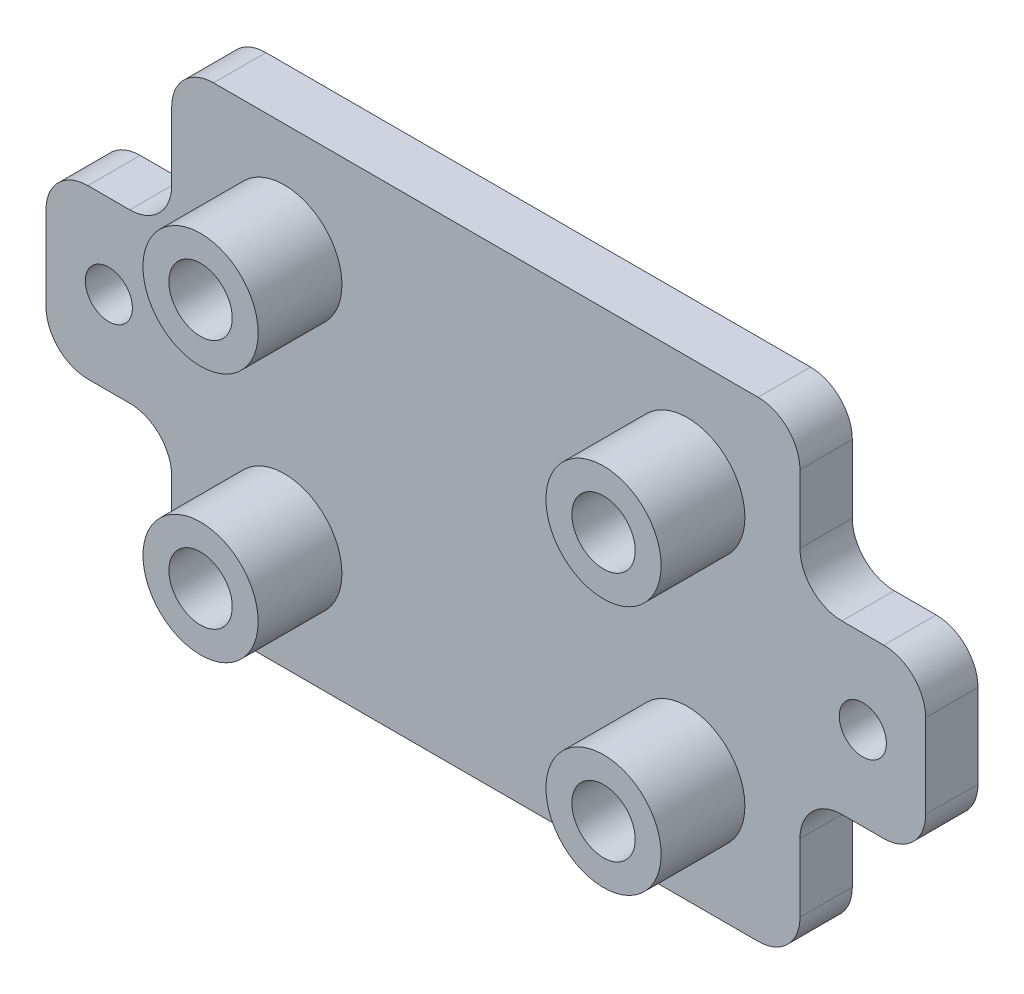
ISO-10303-21;
HEADER;
FILE_DESCRIPTION(('STEP AP214'),'2;1');
FILE_NAME('part.step','',(''),(''),'','','');
FILE_SCHEMA(('AUTOMOTIVE_DESIGN { 1 0 10303 214 1 1 1 1 }'));
ENDSEC;
DATA;
#1=APPLICATION_CONTEXT('core data for automotive mechanical design processes');
#2=APPLICATION_PROTOCOL_DEFINITION('international standard','automotive_design',2000,#1);
#3=PRODUCT_CONTEXT('',#1,'mechanical');
#4=PRODUCT('Part','Part','',(#3));
#5=PRODUCT_RELATED_PRODUCT_CATEGORY('part','',(#4));
#6=PRODUCT_DEFINITION_FORMATION('','',#4);
#7=PRODUCT_DEFINITION_CONTEXT('part definition',#1,'design');
#8=PRODUCT_DEFINITION('design','',#6,#7);
#9=PRODUCT_DEFINITION_SHAPE('','',#8);
#10=(LENGTH_UNIT() NAMED_UNIT(*) SI_UNIT(.MILLI.,.METRE.));
#11=(NAMED_UNIT(*) PLANE_ANGLE_UNIT() SI_UNIT($,.RADIAN.));
#12=(NAMED_UNIT(*) SI_UNIT($,.STERADIAN.) SOLID_ANGLE_UNIT());
#13=UNCERTAINTY_MEASURE_WITH_UNIT(LENGTH_MEASURE(1.E-05),#10,'distance_accuracy_value','');
#14=(GEOMETRIC_REPRESENTATION_CONTEXT(3) GLOBAL_UNCERTAINTY_ASSIGNED_CONTEXT((#13)) GLOBAL_UNIT_ASSIGNED_CONTEXT((#10,
#11,#12)) REPRESENTATION_CONTEXT('',''));
#15=CARTESIAN_POINT('',(0.,0.,0.));
#16=DIRECTION('',(0.,0.,1.));
#17=DIRECTION('',(1.,0.,0.));
#18=AXIS2_PLACEMENT_3D('',#15,#16,#17);
#19=CARTESIAN_POINT('',(30.,-22.5,5.));
#20=DIRECTION('',(-1.,0.,0.));
#21=DIRECTION('',(0.,0.,1.));
#22=AXIS2_PLACEMENT_3D('',#19,#20,#21);
#23=PLANE('',#22);
#24=DIRECTION('',(0.,1.,0.));
#25=VECTOR('',#24,1.);
#26=CARTESIAN_POINT('',(30.,-22.5,0.));
#27=LINE('',#26,#25);
#28=CARTESIAN_POINT('',(30.,12.,0.));
#29=VERTEX_POINT('',#28);
#30=CARTESIAN_POINT('',(30.,18.5,0.));
#31=VERTEX_POINT('',#30);
#32=EDGE_CURVE('E225',#29,#31,#27,.T.);
#33=ORIENTED_EDGE('',*,*,#32,.T.);
#34=DIRECTION('',(0.,0.,-1.));
#35=VECTOR('',#34,1.);
#36=CARTESIAN_POINT('',(30.,18.5,5.));
#37=LINE('',#36,#35);
#38=CARTESIAN_POINT('',(30.,18.5,5.));
#39=VERTEX_POINT('',#38);
#40=EDGE_CURVE('E324',#31,#39,#37,.F.);
#41=ORIENTED_EDGE('',*,*,#40,.T.);
#42=DIRECTION('',(0.,1.,0.));
#43=VECTOR('',#42,1.);
#44=CARTESIAN_POINT('',(30.,-22.5,5.));
#45=LINE('',#44,#43);
#46=CARTESIAN_POINT('',(30.,12.,5.));
#47=VERTEX_POINT('',#46);
#48=EDGE_CURVE('E366',#47,#39,#45,.T.);
#49=ORIENTED_EDGE('',*,*,#48,.F.);
#50=DIRECTION('',(0.,0.,1.));
#51=VECTOR('',#50,1.);
#52=CARTESIAN_POINT('',(30.,12.,5.));
#53=LINE('',#52,#51);
#54=EDGE_CURVE('E322',#47,#29,#53,.F.);
#55=ORIENTED_EDGE('',*,*,#54,.T.);
#56=EDGE_LOOP('',(#33,#41,#49,#55));
#57=FACE_BOUND('',#56,.T.);
#58=ADVANCED_FACE('F37',(#57),#23,.F.);
#59=CARTESIAN_POINT('',(-30.,-22.5,5.));
#60=DIRECTION('',(1.,0.,0.));
#61=DIRECTION('',(0.,0.,-1.));
#62=AXIS2_PLACEMENT_3D('',#59,#60,#61);
#63=PLANE('',#62);
#64=DIRECTION('',(0.,-1.,0.));
#65=VECTOR('',#64,1.);
#66=CARTESIAN_POINT('',(-30.,-22.5,0.));
#67=LINE('',#66,#65);
#68=CARTESIAN_POINT('',(-30.,-11.9999999999997,0.));
#69=VERTEX_POINT('',#68);
#70=CARTESIAN_POINT('',(-30.,-18.5,0.));
#71=VERTEX_POINT('',#70);
#72=EDGE_CURVE('E232',#69,#71,#67,.T.);
#73=ORIENTED_EDGE('',*,*,#72,.T.);
#74=DIRECTION('',(0.,0.,-1.));
#75=VECTOR('',#74,1.);
#76=CARTESIAN_POINT('',(-30.,-18.5,5.));
#77=LINE('',#76,#75);
#78=CARTESIAN_POINT('',(-30.,-18.5,5.));
#79=VERTEX_POINT('',#78);
#80=EDGE_CURVE('E202',#71,#79,#77,.F.);
#81=ORIENTED_EDGE('',*,*,#80,.T.);
#82=DIRECTION('',(0.,-1.,0.));
#83=VECTOR('',#82,1.);
#84=CARTESIAN_POINT('',(-30.,-22.5,5.));
#85=LINE('',#84,#83);
#86=CARTESIAN_POINT('',(-30.,-11.9999999999997,5.));
#87=VERTEX_POINT('',#86);
#88=EDGE_CURVE('E238',#87,#79,#85,.T.);
#89=ORIENTED_EDGE('',*,*,#88,.F.);
#90=DIRECTION('',(0.,0.,1.));
#91=VECTOR('',#90,1.);
#92=CARTESIAN_POINT('',(-30.,-11.9999999999997,5.));
#93=LINE('',#92,#91);
#94=EDGE_CURVE('E207',#87,#69,#93,.F.);
#95=ORIENTED_EDGE('',*,*,#94,.T.);
#96=EDGE_LOOP('',(#73,#81,#89,#95));
#97=FACE_BOUND('',#96,.T.);
#98=ADVANCED_FACE('F509',(#97),#63,.F.);
#99=CARTESIAN_POINT('',(-30.,18.5,5.));
#100=VERTEX_POINT('',#99);
#101=CARTESIAN_POINT('',(-30.,12.0000000000005,5.));
#102=VERTEX_POINT('',#101);
#103=EDGE_CURVE('E373',#100,#102,#85,.T.);
#104=ORIENTED_EDGE('',*,*,#103,.F.);
#105=DIRECTION('',(0.,0.,-1.));
#106=VECTOR('',#105,1.);
#107=CARTESIAN_POINT('',(-30.,18.5,5.));
#108=LINE('',#107,#106);
#109=CARTESIAN_POINT('',(-30.,18.5,0.));
#110=VERTEX_POINT('',#109);
#111=EDGE_CURVE('E274',#100,#110,#108,.T.);
#112=ORIENTED_EDGE('',*,*,#111,.T.);
#113=CARTESIAN_POINT('',(-30.,12.0000000000005,0.));
#114=VERTEX_POINT('',#113);
#115=EDGE_CURVE('E226',#110,#114,#67,.T.);
#116=ORIENTED_EDGE('',*,*,#115,.T.);
#117=DIRECTION('',(0.,0.,1.));
#118=VECTOR('',#117,1.);
#119=CARTESIAN_POINT('',(-30.,12.0000000000005,5.));
#120=LINE('',#119,#118);
#121=EDGE_CURVE('E271',#114,#102,#120,.T.);
#122=ORIENTED_EDGE('',*,*,#121,.T.);
#123=EDGE_LOOP('',(#104,#112,#116,#122));
#124=FACE_BOUND('',#123,.T.);
#125=ADVANCED_FACE('F389',(#124),#63,.F.);
#126=CARTESIAN_POINT('',(30.,-22.5,5.));
#127=DIRECTION('',(0.,1.,0.));
#128=DIRECTION('',(-1.,0.,0.));
#129=AXIS2_PLACEMENT_3D('',#126,#127,#128);
#130=PLANE('',#129);
#131=DIRECTION('',(1.,0.,0.));
#132=VECTOR('',#131,1.);
#133=CARTESIAN_POINT('',(30.,-22.5,0.));
#134=LINE('',#133,#132);
#135=CARTESIAN_POINT('',(-26.,-22.5,0.));
#136=VERTEX_POINT('',#135);
#137=CARTESIAN_POINT('',(26.,-22.5,0.));
#138=VERTEX_POINT('',#137);
#139=EDGE_CURVE('E214',#136,#138,#134,.T.);
#140=ORIENTED_EDGE('',*,*,#139,.T.);
#141=DIRECTION('',(0.,0.,-1.));
#142=VECTOR('',#141,1.);
#143=CARTESIAN_POINT('',(26.,-22.5,5.));
#144=LINE('',#143,#142);
#145=CARTESIAN_POINT('',(26.,-22.5,5.));
#146=VERTEX_POINT('',#145);
#147=EDGE_CURVE('E340',#138,#146,#144,.F.);
#148=ORIENTED_EDGE('',*,*,#147,.T.);
#149=DIRECTION('',(1.,0.,0.));
#150=VECTOR('',#149,1.);
#151=CARTESIAN_POINT('',(30.,-22.5,5.));
#152=LINE('',#151,#150);
#153=CARTESIAN_POINT('',(-26.,-22.5,5.));
#154=VERTEX_POINT('',#153);
#155=EDGE_CURVE('E217',#154,#146,#152,.T.);
#156=ORIENTED_EDGE('',*,*,#155,.F.);
#157=DIRECTION('',(0.,0.,-1.));
#158=VECTOR('',#157,1.);
#159=CARTESIAN_POINT('',(-26.,-22.5,5.));
#160=LINE('',#159,#158);
#161=EDGE_CURVE('E201',#154,#136,#160,.T.);
#162=ORIENTED_EDGE('',*,*,#161,.T.);
#163=EDGE_LOOP('',(#140,#148,#156,#162));
#164=FACE_BOUND('',#163,.T.);
#165=ADVANCED_FACE('F213',(#164),#130,.F.);
#166=CARTESIAN_POINT('',(30.,-18.5,0.));
#167=VERTEX_POINT('',#166);
#168=CARTESIAN_POINT('',(30.,-12.,0.));
#169=VERTEX_POINT('',#168);
#170=EDGE_CURVE('E229',#167,#169,#27,.T.);
#171=ORIENTED_EDGE('',*,*,#170,.T.);
#172=DIRECTION('',(0.,0.,1.));
#173=VECTOR('',#172,1.);
#174=CARTESIAN_POINT('',(30.,-12.,5.));
#175=LINE('',#174,#173);
#176=CARTESIAN_POINT('',(30.,-12.,5.));
#177=VERTEX_POINT('',#176);
#178=EDGE_CURVE('E336',#169,#177,#175,.T.);
#179=ORIENTED_EDGE('',*,*,#178,.T.);
#180=CARTESIAN_POINT('',(30.,-18.5,5.));
#181=VERTEX_POINT('',#180);
#182=EDGE_CURVE('E371',#181,#177,#45,.T.);
#183=ORIENTED_EDGE('',*,*,#182,.F.);
#184=DIRECTION('',(0.,0.,-1.));
#185=VECTOR('',#184,1.);
#186=CARTESIAN_POINT('',(30.,-18.5,5.));
#187=LINE('',#186,#185);
#188=EDGE_CURVE('E333',#181,#167,#187,.T.);
#189=ORIENTED_EDGE('',*,*,#188,.T.);
#190=EDGE_LOOP('',(#171,#179,#183,#189));
#191=FACE_BOUND('',#190,.T.);
#192=ADVANCED_FACE('F511',(#191),#23,.F.);
#193=CARTESIAN_POINT('',(30.,22.5,5.));
#194=DIRECTION('',(0.,-1.,0.));
#195=DIRECTION('',(1.,0.,0.));
#196=AXIS2_PLACEMENT_3D('',#193,#194,#195);
#197=PLANE('',#196);
#198=DIRECTION('',(-1.,0.,0.));
#199=VECTOR('',#198,1.);
#200=CARTESIAN_POINT('',(30.,22.5,5.));
#201=LINE('',#200,#199);
#202=CARTESIAN_POINT('',(26.,22.5,5.));
#203=VERTEX_POINT('',#202);
#204=CARTESIAN_POINT('',(-26.,22.5,5.));
#205=VERTEX_POINT('',#204);
#206=EDGE_CURVE('E243',#203,#205,#201,.T.);
#207=ORIENTED_EDGE('',*,*,#206,.F.);
#208=DIRECTION('',(0.,0.,-1.));
#209=VECTOR('',#208,1.);
#210=CARTESIAN_POINT('',(26.,22.5,5.));
#211=LINE('',#210,#209);
#212=CARTESIAN_POINT('',(26.,22.5,0.));
#213=VERTEX_POINT('',#212);
#214=EDGE_CURVE('E316',#203,#213,#211,.T.);
#215=ORIENTED_EDGE('',*,*,#214,.T.);
#216=DIRECTION('',(-1.,0.,0.));
#217=VECTOR('',#216,1.);
#218=CARTESIAN_POINT('',(30.,22.5,0.));
#219=LINE('',#218,#217);
#220=CARTESIAN_POINT('',(-26.,22.5,0.));
#221=VERTEX_POINT('',#220);
#222=EDGE_CURVE('E236',#213,#221,#219,.T.);
#223=ORIENTED_EDGE('',*,*,#222,.T.);
#224=DIRECTION('',(0.,0.,-1.));
#225=VECTOR('',#224,1.);
#226=CARTESIAN_POINT('',(-26.,22.5,5.));
#227=LINE('',#226,#225);
#228=EDGE_CURVE('E277',#221,#205,#227,.F.);
#229=ORIENTED_EDGE('',*,*,#228,.T.);
#230=EDGE_LOOP('',(#207,#215,#223,#229));
#231=FACE_BOUND('',#230,.T.);
#232=ADVANCED_FACE('F383',(#231),#197,.F.);
#233=CARTESIAN_POINT('',(0.,0.,5.));
#234=DIRECTION('',(0.,0.,1.));
#235=DIRECTION('',(1.,0.,0.));
#236=AXIS2_PLACEMENT_3D('',#233,#234,#235);
#237=PLANE('',#236);
#238=CARTESIAN_POINT('',(36.,0.,5.));
#239=DIRECTION('',(0.,0.,1.));
#240=DIRECTION('',(1.,0.,0.));
#241=AXIS2_PLACEMENT_3D('',#238,#239,#240);
#242=CIRCLE('',#241,2.24999999999999);
#243=CARTESIAN_POINT('',(38.25,0.,5.));
#244=VERTEX_POINT('',#243);
#245=EDGE_CURVE('E472',#244,#244,#242,.T.);
#246=ORIENTED_EDGE('',*,*,#245,.F.);
#247=EDGE_LOOP('',(#246));
#248=FACE_BOUND('',#247,.T.);
#249=CARTESIAN_POINT('',(-36.,0.,5.));
#250=DIRECTION('',(0.,0.,1.));
#251=DIRECTION('',(1.,0.,0.));
#252=AXIS2_PLACEMENT_3D('',#249,#250,#251);
#253=CIRCLE('',#252,2.24999999999999);
#254=CARTESIAN_POINT('',(-33.75,0.,5.));
#255=VERTEX_POINT('',#254);
#256=EDGE_CURVE('E456',#255,#255,#253,.T.);
#257=ORIENTED_EDGE('',*,*,#256,.F.);
#258=EDGE_LOOP('',(#257));
#259=FACE_BOUND('',#258,.T.);
#260=CARTESIAN_POINT('',(19.2405,-11.938,5.));
#261=DIRECTION('',(0.,0.,1.));
#262=DIRECTION('',(1.,0.,0.));
#263=AXIS2_PLACEMENT_3D('',#260,#261,#262);
#264=CIRCLE('',#263,5.5);
#265=CARTESIAN_POINT('',(24.7405,-11.938,5.));
#266=VERTEX_POINT('',#265);
#267=EDGE_CURVE('E430',#266,#266,#264,.T.);
#268=ORIENTED_EDGE('',*,*,#267,.F.);
#269=EDGE_LOOP('',(#268));
#270=FACE_BOUND('',#269,.T.);
#271=CARTESIAN_POINT('',(19.2405,11.938,5.));
#272=DIRECTION('',(0.,0.,1.));
#273=DIRECTION('',(1.,0.,0.));
#274=AXIS2_PLACEMENT_3D('',#271,#272,#273);
#275=CIRCLE('',#274,5.5);
#276=CARTESIAN_POINT('',(24.7405,11.938,5.));
#277=VERTEX_POINT('',#276);
#278=EDGE_CURVE('E421',#277,#277,#275,.T.);
#279=ORIENTED_EDGE('',*,*,#278,.F.);
#280=EDGE_LOOP('',(#279));
#281=FACE_BOUND('',#280,.T.);
#282=CARTESIAN_POINT('',(-19.2405,-11.938,5.));
#283=DIRECTION('',(0.,0.,1.));
#284=DIRECTION('',(1.,0.,0.));
#285=AXIS2_PLACEMENT_3D('',#282,#283,#284);
#286=CIRCLE('',#285,5.5);
#287=CARTESIAN_POINT('',(-13.7405,-11.938,5.));
#288=VERTEX_POINT('',#287);
#289=EDGE_CURVE('E412',#288,#288,#286,.T.);
#290=ORIENTED_EDGE('',*,*,#289,.F.);
#291=EDGE_LOOP('',(#290));
#292=FACE_BOUND('',#291,.T.);
#293=CARTESIAN_POINT('',(-19.2405,11.938,5.));
#294=DIRECTION('',(0.,0.,1.));
#295=DIRECTION('',(1.,0.,0.));
#296=AXIS2_PLACEMENT_3D('',#293,#294,#295);
#297=CIRCLE('',#296,5.5);
#298=CARTESIAN_POINT('',(-13.7405,11.938,5.));
#299=VERTEX_POINT('',#298);
#300=EDGE_CURVE('E402',#299,#299,#297,.T.);
#301=ORIENTED_EDGE('',*,*,#300,.F.);
#302=EDGE_LOOP('',(#301));
#303=FACE_BOUND('',#302,.T.);
#304=ORIENTED_EDGE('',*,*,#48,.T.);
#305=CARTESIAN_POINT('',(26.,18.5,5.));
#306=DIRECTION('',(0.,0.,1.));
#307=DIRECTION('',(1.,0.,0.));
#308=AXIS2_PLACEMENT_3D('',#305,#306,#307);
#309=CIRCLE('',#308,4.);
#310=EDGE_CURVE('E328',#39,#203,#309,.T.);
#311=ORIENTED_EDGE('',*,*,#310,.T.);
#312=ORIENTED_EDGE('',*,*,#206,.T.);
#313=CARTESIAN_POINT('',(-26.,18.5,5.));
#314=DIRECTION('',(0.,0.,1.));
#315=DIRECTION('',(1.,0.,0.));
#316=AXIS2_PLACEMENT_3D('',#313,#314,#315);
#317=CIRCLE('',#316,4.);
#318=EDGE_CURVE('E262',#205,#100,#317,.T.);
#319=ORIENTED_EDGE('',*,*,#318,.T.);
#320=ORIENTED_EDGE('',*,*,#103,.T.);
#321=CARTESIAN_POINT('',(-34.,12.0000000000005,5.));
#322=DIRECTION('',(0.,0.,1.));
#323=DIRECTION('',(1.,0.,0.));
#324=AXIS2_PLACEMENT_3D('',#321,#322,#323);
#325=CIRCLE('',#324,4.);
#326=CARTESIAN_POINT('',(-33.9999999999999,8.00000000000051,5.00000000000008));
#327=VERTEX_POINT('',#326);
#328=EDGE_CURVE('E294',#102,#327,#325,.F.);
#329=ORIENTED_EDGE('',*,*,#328,.T.);
#330=DIRECTION('',(0.999999999999999,0.,0.));
#331=VECTOR('',#330,1.);
#332=CARTESIAN_POINT('',(0.,8.00000000000037,5.));
#333=LINE('',#332,#331);
#334=CARTESIAN_POINT('',(-37.9999999999999,8.00000000000053,5.00000000000009));
#335=VERTEX_POINT('',#334);
#336=EDGE_CURVE('E438',#335,#327,#333,.T.);
#337=ORIENTED_EDGE('',*,*,#336,.F.);
#338=CARTESIAN_POINT('',(-38.,4.00000000000053,5.));
#339=DIRECTION('',(0.,0.,1.));
#340=DIRECTION('',(1.,0.,0.));
#341=AXIS2_PLACEMENT_3D('',#338,#339,#340);
#342=CIRCLE('',#341,4.);
#343=CARTESIAN_POINT('',(-42.,4.0000000000005,5.));
#344=VERTEX_POINT('',#343);
#345=EDGE_CURVE('E260',#335,#344,#342,.T.);
#346=ORIENTED_EDGE('',*,*,#345,.T.);
#347=DIRECTION('',(0.,-1.,0.));
#348=VECTOR('',#347,1.);
#349=CARTESIAN_POINT('',(-42.,3.60822483003176E-13,5.));
#350=LINE('',#349,#348);
#351=CARTESIAN_POINT('',(-42.,-3.99999999999966,5.));
#352=VERTEX_POINT('',#351);
#353=EDGE_CURVE('E444',#344,#352,#350,.T.);
#354=ORIENTED_EDGE('',*,*,#353,.T.);
#355=CARTESIAN_POINT('',(-38.,-3.99999999999965,5.));
#356=DIRECTION('',(0.,0.,1.));
#357=DIRECTION('',(1.,0.,0.));
#358=AXIS2_PLACEMENT_3D('',#355,#356,#357);
#359=CIRCLE('',#358,4.);
#360=CARTESIAN_POINT('',(-37.9999999999999,-7.99999999999965,5.00000000000009));
#361=VERTEX_POINT('',#360);
#362=EDGE_CURVE('E258',#352,#361,#359,.T.);
#363=ORIENTED_EDGE('',*,*,#362,.T.);
#364=DIRECTION('',(0.999999999999999,0.,0.));
#365=VECTOR('',#364,1.);
#366=CARTESIAN_POINT('',(0.,-7.99999999999981,5.));
#367=LINE('',#366,#365);
#368=CARTESIAN_POINT('',(-33.9999999999999,-7.99999999999967,5.00000000000008));
#369=VERTEX_POINT('',#368);
#370=EDGE_CURVE('E441',#361,#369,#367,.T.);
#371=ORIENTED_EDGE('',*,*,#370,.T.);
#372=CARTESIAN_POINT('',(-34.,-11.9999999999997,5.));
#373=DIRECTION('',(0.,0.,1.));
#374=DIRECTION('',(1.,0.,0.));
#375=AXIS2_PLACEMENT_3D('',#372,#373,#374);
#376=CIRCLE('',#375,4.);
#377=EDGE_CURVE('E290',#369,#87,#376,.F.);
#378=ORIENTED_EDGE('',*,*,#377,.T.);
#379=ORIENTED_EDGE('',*,*,#88,.T.);
#380=CARTESIAN_POINT('',(-26.,-18.5,5.));
#381=DIRECTION('',(0.,0.,1.));
#382=DIRECTION('',(1.,0.,0.));
#383=AXIS2_PLACEMENT_3D('',#380,#381,#382);
#384=CIRCLE('',#383,4.);
#385=EDGE_CURVE('E264',#79,#154,#384,.T.);
#386=ORIENTED_EDGE('',*,*,#385,.T.);
#387=ORIENTED_EDGE('',*,*,#155,.T.);
#388=CARTESIAN_POINT('',(26.,-18.5,5.));
#389=DIRECTION('',(0.,0.,1.));
#390=DIRECTION('',(1.,0.,0.));
#391=AXIS2_PLACEMENT_3D('',#388,#389,#390);
#392=CIRCLE('',#391,4.);
#393=EDGE_CURVE('E326',#146,#181,#392,.T.);
#394=ORIENTED_EDGE('',*,*,#393,.T.);
#395=ORIENTED_EDGE('',*,*,#182,.T.);
#396=CARTESIAN_POINT('',(34.,-12.,5.));
#397=DIRECTION('',(0.,0.,1.));
#398=DIRECTION('',(1.,0.,0.));
#399=AXIS2_PLACEMENT_3D('',#396,#397,#398);
#400=CIRCLE('',#399,4.);
#401=CARTESIAN_POINT('',(34.,-8.,5.));
#402=VERTEX_POINT('',#401);
#403=EDGE_CURVE('E45',#177,#402,#400,.F.);
#404=ORIENTED_EDGE('',*,*,#403,.T.);
#405=DIRECTION('',(-1.,0.,0.));
#406=VECTOR('',#405,1.);
#407=CARTESIAN_POINT('',(0.,-8.,5.));
#408=LINE('',#407,#406);
#409=CARTESIAN_POINT('',(38.,-8.,5.));
#410=VERTEX_POINT('',#409);
#411=EDGE_CURVE('E459',#410,#402,#408,.T.);
#412=ORIENTED_EDGE('',*,*,#411,.F.);
#413=CARTESIAN_POINT('',(38.,-4.,5.));
#414=DIRECTION('',(0.,0.,1.));
#415=DIRECTION('',(1.,0.,0.));
#416=AXIS2_PLACEMENT_3D('',#413,#414,#415);
#417=CIRCLE('',#416,4.);
#418=CARTESIAN_POINT('',(42.,-4.,5.));
#419=VERTEX_POINT('',#418);
#420=EDGE_CURVE('E303',#410,#419,#417,.T.);
#421=ORIENTED_EDGE('',*,*,#420,.T.);
#422=DIRECTION('',(0.,-1.,0.));
#423=VECTOR('',#422,1.);
#424=CARTESIAN_POINT('',(42.,0.,5.));
#425=LINE('',#424,#423);
#426=CARTESIAN_POINT('',(42.,4.,5.));
#427=VERTEX_POINT('',#426);
#428=EDGE_CURVE('E462',#427,#419,#425,.T.);
#429=ORIENTED_EDGE('',*,*,#428,.F.);
#430=CARTESIAN_POINT('',(38.,4.,5.));
#431=DIRECTION('',(0.,0.,1.));
#432=DIRECTION('',(1.,0.,0.));
#433=AXIS2_PLACEMENT_3D('',#430,#431,#432);
#434=CIRCLE('',#433,4.);
#435=CARTESIAN_POINT('',(38.,8.,5.));
#436=VERTEX_POINT('',#435);
#437=EDGE_CURVE('E305',#427,#436,#434,.T.);
#438=ORIENTED_EDGE('',*,*,#437,.T.);
#439=DIRECTION('',(-1.,0.,0.));
#440=VECTOR('',#439,1.);
#441=CARTESIAN_POINT('',(0.,8.,5.));
#442=LINE('',#441,#440);
#443=CARTESIAN_POINT('',(34.,8.,5.));
#444=VERTEX_POINT('',#443);
#445=EDGE_CURVE('E368',#436,#444,#442,.T.);
#446=ORIENTED_EDGE('',*,*,#445,.T.);
#447=CARTESIAN_POINT('',(34.,12.,5.));
#448=DIRECTION('',(0.,0.,1.));
#449=DIRECTION('',(1.,0.,0.));
#450=AXIS2_PLACEMENT_3D('',#447,#448,#449);
#451=CIRCLE('',#450,4.);
#452=EDGE_CURVE('E342',#444,#47,#451,.F.);
#453=ORIENTED_EDGE('',*,*,#452,.T.);
#454=EDGE_LOOP('',(#304,#311,#312,#319,#320,#329,#337,#346,#354,#363,#371,#378,#379,#386,#387,
#394,#395,#404,#412,#421,#429,#438,#446,#453));
#455=FACE_BOUND('',#454,.T.);
#456=ADVANCED_FACE('F365',(#248,#259,#270,#281,#292,#303,#455),#237,.T.);
#457=CARTESIAN_POINT('',(0.,0.,0.));
#458=DIRECTION('',(0.,0.,1.));
#459=DIRECTION('',(1.,0.,0.));
#460=AXIS2_PLACEMENT_3D('',#457,#458,#459);
#461=PLANE('',#460);
#462=CARTESIAN_POINT('',(36.,0.,0.));
#463=DIRECTION('',(0.,0.,1.));
#464=DIRECTION('',(1.,0.,0.));
#465=AXIS2_PLACEMENT_3D('',#462,#463,#464);
#466=CIRCLE('',#465,2.25);
#467=CARTESIAN_POINT('',(38.25,0.,0.));
#468=VERTEX_POINT('',#467);
#469=EDGE_CURVE('E465',#468,#468,#466,.T.);
#470=ORIENTED_EDGE('',*,*,#469,.T.);
#471=EDGE_LOOP('',(#470));
#472=FACE_BOUND('',#471,.T.);
#473=CARTESIAN_POINT('',(-36.,0.,0.));
#474=DIRECTION('',(0.,0.,1.));
#475=DIRECTION('',(1.,0.,0.));
#476=AXIS2_PLACEMENT_3D('',#473,#474,#475);
#477=CIRCLE('',#476,2.25);
#478=CARTESIAN_POINT('',(-33.75,0.,0.));
#479=VERTEX_POINT('',#478);
#480=EDGE_CURVE('E447',#479,#479,#477,.T.);
#481=ORIENTED_EDGE('',*,*,#480,.T.);
#482=EDGE_LOOP('',(#481));
#483=FACE_BOUND('',#482,.T.);
#484=ORIENTED_EDGE('',*,*,#222,.F.);
#485=CARTESIAN_POINT('',(26.,18.5,0.));
#486=DIRECTION('',(0.,0.,1.));
#487=DIRECTION('',(1.,0.,0.));
#488=AXIS2_PLACEMENT_3D('',#485,#486,#487);
#489=CIRCLE('',#488,4.);
#490=EDGE_CURVE('E320',#213,#31,#489,.F.);
#491=ORIENTED_EDGE('',*,*,#490,.T.);
#492=ORIENTED_EDGE('',*,*,#32,.F.);
#493=CARTESIAN_POINT('',(34.,12.,0.));
#494=DIRECTION('',(0.,0.,1.));
#495=DIRECTION('',(1.,0.,0.));
#496=AXIS2_PLACEMENT_3D('',#493,#494,#495);
#497=CIRCLE('',#496,4.);
#498=CARTESIAN_POINT('',(34.,8.,0.));
#499=VERTEX_POINT('',#498);
#500=EDGE_CURVE('E344',#29,#499,#497,.T.);
#501=ORIENTED_EDGE('',*,*,#500,.T.);
#502=DIRECTION('',(-1.,0.,0.));
#503=VECTOR('',#502,1.);
#504=CARTESIAN_POINT('',(0.,8.,0.));
#505=LINE('',#504,#503);
#506=CARTESIAN_POINT('',(38.,8.,0.));
#507=VERTEX_POINT('',#506);
#508=EDGE_CURVE('E349',#507,#499,#505,.T.);
#509=ORIENTED_EDGE('',*,*,#508,.F.);
#510=CARTESIAN_POINT('',(38.,4.,0.));
#511=DIRECTION('',(0.,0.,1.));
#512=DIRECTION('',(1.,0.,0.));
#513=AXIS2_PLACEMENT_3D('',#510,#511,#512);
#514=CIRCLE('',#513,4.);
#515=CARTESIAN_POINT('',(42.,4.,0.));
#516=VERTEX_POINT('',#515);
#517=EDGE_CURVE('E311',#507,#516,#514,.F.);
#518=ORIENTED_EDGE('',*,*,#517,.T.);
#519=DIRECTION('',(0.,-1.,0.));
#520=VECTOR('',#519,1.);
#521=CARTESIAN_POINT('',(42.,0.,0.));
#522=LINE('',#521,#520);
#523=CARTESIAN_POINT('',(42.,-4.,0.));
#524=VERTEX_POINT('',#523);
#525=EDGE_CURVE('E360',#516,#524,#522,.T.);
#526=ORIENTED_EDGE('',*,*,#525,.T.);
#527=CARTESIAN_POINT('',(38.,-4.,0.));
#528=DIRECTION('',(0.,0.,1.));
#529=DIRECTION('',(1.,0.,0.));
#530=AXIS2_PLACEMENT_3D('',#527,#528,#529);
#531=CIRCLE('',#530,4.);
#532=CARTESIAN_POINT('',(38.,-8.,0.));
#533=VERTEX_POINT('',#532);
#534=EDGE_CURVE('E309',#524,#533,#531,.F.);
#535=ORIENTED_EDGE('',*,*,#534,.T.);
#536=DIRECTION('',(-1.,0.,0.));
#537=VECTOR('',#536,1.);
#538=CARTESIAN_POINT('',(0.,-8.,0.));
#539=LINE('',#538,#537);
#540=CARTESIAN_POINT('',(34.,-8.,0.));
#541=VERTEX_POINT('',#540);
#542=EDGE_CURVE('E359',#533,#541,#539,.T.);
#543=ORIENTED_EDGE('',*,*,#542,.T.);
#544=CARTESIAN_POINT('',(34.,-12.,0.));
#545=DIRECTION('',(0.,0.,1.));
#546=DIRECTION('',(1.,0.,0.));
#547=AXIS2_PLACEMENT_3D('',#544,#545,#546);
#548=CIRCLE('',#547,4.);
#549=EDGE_CURVE('E11',#541,#169,#548,.T.);
#550=ORIENTED_EDGE('',*,*,#549,.T.);
#551=ORIENTED_EDGE('',*,*,#170,.F.);
#552=CARTESIAN_POINT('',(26.,-18.5,0.));
#553=DIRECTION('',(0.,0.,1.));
#554=DIRECTION('',(1.,0.,0.));
#555=AXIS2_PLACEMENT_3D('',#552,#553,#554);
#556=CIRCLE('',#555,4.);
#557=EDGE_CURVE('E224',#167,#138,#556,.F.);
#558=ORIENTED_EDGE('',*,*,#557,.T.);
#559=ORIENTED_EDGE('',*,*,#139,.F.);
#560=CARTESIAN_POINT('',(-26.,-18.5,0.));
#561=DIRECTION('',(0.,0.,1.));
#562=DIRECTION('',(1.,0.,0.));
#563=AXIS2_PLACEMENT_3D('',#560,#561,#562);
#564=CIRCLE('',#563,4.);
#565=EDGE_CURVE('E197',#136,#71,#564,.F.);
#566=ORIENTED_EDGE('',*,*,#565,.T.);
#567=ORIENTED_EDGE('',*,*,#72,.F.);
#568=CARTESIAN_POINT('',(-34.,-11.9999999999997,0.));
#569=DIRECTION('',(0.,0.,1.));
#570=DIRECTION('',(1.,0.,0.));
#571=AXIS2_PLACEMENT_3D('',#568,#569,#570);
#572=CIRCLE('',#571,4.);
#573=CARTESIAN_POINT('',(-33.9999999999999,-7.99999999999967,0.));
#574=VERTEX_POINT('',#573);
#575=EDGE_CURVE('E292',#69,#574,#572,.T.);
#576=ORIENTED_EDGE('',*,*,#575,.T.);
#577=DIRECTION('',(0.999999999999999,0.,0.));
#578=VECTOR('',#577,1.);
#579=CARTESIAN_POINT('',(0.,-7.99999999999981,0.));
#580=LINE('',#579,#578);
#581=CARTESIAN_POINT('',(-37.9999999999999,-7.99999999999965,0.));
#582=VERTEX_POINT('',#581);
#583=EDGE_CURVE('E449',#582,#574,#580,.T.);
#584=ORIENTED_EDGE('',*,*,#583,.F.);
#585=CARTESIAN_POINT('',(-38.,-3.99999999999965,0.));
#586=DIRECTION('',(0.,0.,1.));
#587=DIRECTION('',(1.,0.,0.));
#588=AXIS2_PLACEMENT_3D('',#585,#586,#587);
#589=CIRCLE('',#588,4.);
#590=CARTESIAN_POINT('',(-42.,-3.99999999999966,0.));
#591=VERTEX_POINT('',#590);
#592=EDGE_CURVE('E218',#582,#591,#589,.F.);
#593=ORIENTED_EDGE('',*,*,#592,.T.);
#594=DIRECTION('',(0.,-1.,0.));
#595=VECTOR('',#594,1.);
#596=CARTESIAN_POINT('',(-42.,3.60822483003176E-13,0.));
#597=LINE('',#596,#595);
#598=CARTESIAN_POINT('',(-42.,4.0000000000005,0.));
#599=VERTEX_POINT('',#598);
#600=EDGE_CURVE('E440',#599,#591,#597,.T.);
#601=ORIENTED_EDGE('',*,*,#600,.F.);
#602=CARTESIAN_POINT('',(-38.,4.00000000000053,0.));
#603=DIRECTION('',(0.,0.,1.));
#604=DIRECTION('',(1.,0.,0.));
#605=AXIS2_PLACEMENT_3D('',#602,#603,#604);
#606=CIRCLE('',#605,4.);
#607=CARTESIAN_POINT('',(-37.9999999999999,8.00000000000053,0.));
#608=VERTEX_POINT('',#607);
#609=EDGE_CURVE('E252',#599,#608,#606,.F.);
#610=ORIENTED_EDGE('',*,*,#609,.T.);
#611=DIRECTION('',(0.999999999999999,0.,0.));
#612=VECTOR('',#611,1.);
#613=CARTESIAN_POINT('',(0.,8.00000000000037,0.));
#614=LINE('',#613,#612);
#615=CARTESIAN_POINT('',(-33.9999999999999,8.00000000000051,0.));
#616=VERTEX_POINT('',#615);
#617=EDGE_CURVE('E394',#608,#616,#614,.T.);
#618=ORIENTED_EDGE('',*,*,#617,.T.);
#619=CARTESIAN_POINT('',(-34.,12.0000000000005,0.));
#620=DIRECTION('',(0.,0.,1.));
#621=DIRECTION('',(1.,0.,0.));
#622=AXIS2_PLACEMENT_3D('',#619,#620,#621);
#623=CIRCLE('',#622,4.);
#624=EDGE_CURVE('E296',#616,#114,#623,.T.);
#625=ORIENTED_EDGE('',*,*,#624,.T.);
#626=ORIENTED_EDGE('',*,*,#115,.F.);
#627=CARTESIAN_POINT('',(-26.,18.5,0.));
#628=DIRECTION('',(0.,0.,1.));
#629=DIRECTION('',(1.,0.,0.));
#630=AXIS2_PLACEMENT_3D('',#627,#628,#629);
#631=CIRCLE('',#630,4.);
#632=EDGE_CURVE('E208',#110,#221,#631,.F.);
#633=ORIENTED_EDGE('',*,*,#632,.T.);
#634=EDGE_LOOP('',(#484,#491,#492,#501,#509,#518,#526,#535,#543,#550,#551,#558,#559,#566,#567,
#576,#584,#593,#601,#610,#618,#625,#626,#633));
#635=FACE_BOUND('',#634,.T.);
#636=ADVANCED_FACE('F222',(#472,#483,#635),#461,.F.);
#637=CARTESIAN_POINT('',(-19.2405,11.938,13.));
#638=DIRECTION('',(0.,0.,1.));
#639=DIRECTION('',(1.,0.,0.));
#640=AXIS2_PLACEMENT_3D('',#637,#638,#639);
#641=PLANE('',#640);
#642=CARTESIAN_POINT('',(-19.2405,11.938,13.));
#643=DIRECTION('',(0.,0.,1.));
#644=DIRECTION('',(1.,0.,0.));
#645=AXIS2_PLACEMENT_3D('',#642,#643,#644);
#646=CIRCLE('',#645,5.5);
#647=CARTESIAN_POINT('',(-13.7405,11.938,13.));
#648=VERTEX_POINT('',#647);
#649=EDGE_CURVE('E405',#648,#648,#646,.T.);
#650=ORIENTED_EDGE('',*,*,#649,.T.);
#651=EDGE_LOOP('',(#650));
#652=FACE_BOUND('',#651,.T.);
#653=CARTESIAN_POINT('',(-19.2405,11.938,13.));
#654=DIRECTION('',(0.,0.,1.));
#655=DIRECTION('',(1.,0.,0.));
#656=AXIS2_PLACEMENT_3D('',#653,#654,#655);
#657=CIRCLE('',#656,3.025);
#658=CARTESIAN_POINT('',(-16.2155,11.938,13.));
#659=VERTEX_POINT('',#658);
#660=EDGE_CURVE('E406',#659,#659,#657,.T.);
#661=ORIENTED_EDGE('',*,*,#660,.F.);
#662=EDGE_LOOP('',(#661));
#663=FACE_BOUND('',#662,.T.);
#664=ADVANCED_FACE('F496',(#652,#663),#641,.T.);
#665=CARTESIAN_POINT('',(-19.2405,11.938,13.));
#666=DIRECTION('',(0.,0.,-1.));
#667=DIRECTION('',(-1.,0.,0.));
#668=AXIS2_PLACEMENT_3D('',#665,#666,#667);
#669=CYLINDRICAL_SURFACE('',#668,5.5);
#670=ORIENTED_EDGE('',*,*,#649,.F.);
#671=EDGE_LOOP('',(#670));
#672=FACE_BOUND('',#671,.T.);
#673=ORIENTED_EDGE('',*,*,#300,.T.);
#674=EDGE_LOOP('',(#673));
#675=FACE_BOUND('',#674,.T.);
#676=ADVANCED_FACE('F493',(#672,#675),#669,.T.);
#677=CARTESIAN_POINT('',(-19.2405,11.938,13.));
#678=DIRECTION('',(0.,0.,-1.));
#679=DIRECTION('',(-1.,0.,0.));
#680=AXIS2_PLACEMENT_3D('',#677,#678,#679);
#681=CYLINDRICAL_SURFACE('',#680,3.025);
#682=ORIENTED_EDGE('',*,*,#660,.T.);
#683=EDGE_LOOP('',(#682));
#684=FACE_BOUND('',#683,.T.);
#685=CARTESIAN_POINT('',(-19.2405,11.938,5.));
#686=DIRECTION('',(0.,0.,1.));
#687=DIRECTION('',(1.,0.,0.));
#688=AXIS2_PLACEMENT_3D('',#685,#686,#687);
#689=CIRCLE('',#688,3.025);
#690=CARTESIAN_POINT('',(-16.2155,11.938,5.));
#691=VERTEX_POINT('',#690);
#692=EDGE_CURVE('E239',#691,#691,#689,.F.);
#693=ORIENTED_EDGE('',*,*,#692,.T.);
#694=EDGE_LOOP('',(#693));
#695=FACE_BOUND('',#694,.T.);
#696=ADVANCED_FACE('F495',(#684,#695),#681,.F.);
#697=ORIENTED_EDGE('',*,*,#692,.F.);
#698=EDGE_LOOP('',(#697));
#699=FACE_BOUND('',#698,.T.);
#700=ADVANCED_FACE('F482',(#699),#237,.T.);
#701=CARTESIAN_POINT('',(-19.2405,-11.938,13.));
#702=DIRECTION('',(0.,0.,1.));
#703=DIRECTION('',(1.,0.,0.));
#704=AXIS2_PLACEMENT_3D('',#701,#702,#703);
#705=PLANE('',#704);
#706=CARTESIAN_POINT('',(-19.2405,-11.938,13.));
#707=DIRECTION('',(0.,0.,1.));
#708=DIRECTION('',(1.,0.,0.));
#709=AXIS2_PLACEMENT_3D('',#706,#707,#708);
#710=CIRCLE('',#709,5.5);
#711=CARTESIAN_POINT('',(-13.7405,-11.938,13.));
#712=VERTEX_POINT('',#711);
#713=EDGE_CURVE('E411',#712,#712,#710,.T.);
#714=ORIENTED_EDGE('',*,*,#713,.T.);
#715=EDGE_LOOP('',(#714));
#716=FACE_BOUND('',#715,.T.);
#717=CARTESIAN_POINT('',(-19.2405,-11.938,13.));
#718=DIRECTION('',(0.,0.,1.));
#719=DIRECTION('',(1.,0.,0.));
#720=AXIS2_PLACEMENT_3D('',#717,#718,#719);
#721=CIRCLE('',#720,3.025);
#722=CARTESIAN_POINT('',(-16.2155,-11.938,13.));
#723=VERTEX_POINT('',#722);
#724=EDGE_CURVE('E415',#723,#723,#721,.T.);
#725=ORIENTED_EDGE('',*,*,#724,.F.);
#726=EDGE_LOOP('',(#725));
#727=FACE_BOUND('',#726,.T.);
#728=ADVANCED_FACE('F638',(#716,#727),#705,.T.);
#729=CARTESIAN_POINT('',(-19.2405,-11.938,13.));
#730=DIRECTION('',(0.,0.,-1.));
#731=DIRECTION('',(-1.,0.,0.));
#732=AXIS2_PLACEMENT_3D('',#729,#730,#731);
#733=CYLINDRICAL_SURFACE('',#732,5.5);
#734=ORIENTED_EDGE('',*,*,#713,.F.);
#735=EDGE_LOOP('',(#734));
#736=FACE_BOUND('',#735,.T.);
#737=ORIENTED_EDGE('',*,*,#289,.T.);
#738=EDGE_LOOP('',(#737));
#739=FACE_BOUND('',#738,.T.);
#740=ADVANCED_FACE('F636',(#736,#739),#733,.T.);
#741=CARTESIAN_POINT('',(-19.2405,-11.938,13.));
#742=DIRECTION('',(0.,0.,-1.));
#743=DIRECTION('',(-1.,0.,0.));
#744=AXIS2_PLACEMENT_3D('',#741,#742,#743);
#745=CYLINDRICAL_SURFACE('',#744,3.025);
#746=ORIENTED_EDGE('',*,*,#724,.T.);
#747=EDGE_LOOP('',(#746));
#748=FACE_BOUND('',#747,.T.);
#749=CARTESIAN_POINT('',(-19.2405,-11.938,5.));
#750=DIRECTION('',(0.,0.,1.));
#751=DIRECTION('',(1.,0.,0.));
#752=AXIS2_PLACEMENT_3D('',#749,#750,#751);
#753=CIRCLE('',#752,3.025);
#754=CARTESIAN_POINT('',(-16.2155,-11.938,5.));
#755=VERTEX_POINT('',#754);
#756=EDGE_CURVE('E242',#755,#755,#753,.F.);
#757=ORIENTED_EDGE('',*,*,#756,.T.);
#758=EDGE_LOOP('',(#757));
#759=FACE_BOUND('',#758,.T.);
#760=ADVANCED_FACE('F633',(#748,#759),#745,.F.);
#761=ORIENTED_EDGE('',*,*,#756,.F.);
#762=EDGE_LOOP('',(#761));
#763=FACE_BOUND('',#762,.T.);
#764=ADVANCED_FACE('F628',(#763),#237,.T.);
#765=CARTESIAN_POINT('',(19.2405,11.938,13.));
#766=DIRECTION('',(0.,0.,1.));
#767=DIRECTION('',(1.,0.,0.));
#768=AXIS2_PLACEMENT_3D('',#765,#766,#767);
#769=PLANE('',#768);
#770=CARTESIAN_POINT('',(19.2405,11.938,13.));
#771=DIRECTION('',(0.,0.,1.));
#772=DIRECTION('',(1.,0.,0.));
#773=AXIS2_PLACEMENT_3D('',#770,#771,#772);
#774=CIRCLE('',#773,5.5);
#775=CARTESIAN_POINT('',(24.7405,11.938,13.));
#776=VERTEX_POINT('',#775);
#777=EDGE_CURVE('E420',#776,#776,#774,.T.);
#778=ORIENTED_EDGE('',*,*,#777,.T.);
#779=EDGE_LOOP('',(#778));
#780=FACE_BOUND('',#779,.T.);
#781=CARTESIAN_POINT('',(19.2405,11.938,13.));
#782=DIRECTION('',(0.,0.,1.));
#783=DIRECTION('',(1.,0.,0.));
#784=AXIS2_PLACEMENT_3D('',#781,#782,#783);
#785=CIRCLE('',#784,3.025);
#786=CARTESIAN_POINT('',(22.2655,11.938,13.));
#787=VERTEX_POINT('',#786);
#788=EDGE_CURVE('E424',#787,#787,#785,.T.);
#789=ORIENTED_EDGE('',*,*,#788,.F.);
#790=EDGE_LOOP('',(#789));
#791=FACE_BOUND('',#790,.T.);
#792=ADVANCED_FACE('F625',(#780,#791),#769,.T.);
#793=CARTESIAN_POINT('',(19.2405,11.938,13.));
#794=DIRECTION('',(0.,0.,-1.));
#795=DIRECTION('',(-1.,0.,0.));
#796=AXIS2_PLACEMENT_3D('',#793,#794,#795);
#797=CYLINDRICAL_SURFACE('',#796,5.5);
#798=ORIENTED_EDGE('',*,*,#777,.F.);
#799=EDGE_LOOP('',(#798));
#800=FACE_BOUND('',#799,.T.);
#801=ORIENTED_EDGE('',*,*,#278,.T.);
#802=EDGE_LOOP('',(#801));
#803=FACE_BOUND('',#802,.T.);
#804=ADVANCED_FACE('F623',(#800,#803),#797,.T.);
#805=CARTESIAN_POINT('',(19.2405,11.938,13.));
#806=DIRECTION('',(0.,0.,-1.));
#807=DIRECTION('',(-1.,0.,0.));
#808=AXIS2_PLACEMENT_3D('',#805,#806,#807);
#809=CYLINDRICAL_SURFACE('',#808,3.025);
#810=ORIENTED_EDGE('',*,*,#788,.T.);
#811=EDGE_LOOP('',(#810));
#812=FACE_BOUND('',#811,.T.);
#813=CARTESIAN_POINT('',(19.2405,11.938,5.));
#814=DIRECTION('',(0.,0.,1.));
#815=DIRECTION('',(1.,0.,0.));
#816=AXIS2_PLACEMENT_3D('',#813,#814,#815);
#817=CIRCLE('',#816,3.025);
#818=CARTESIAN_POINT('',(22.2655,11.938,5.));
#819=VERTEX_POINT('',#818);
#820=EDGE_CURVE('E246',#819,#819,#817,.F.);
#821=ORIENTED_EDGE('',*,*,#820,.T.);
#822=EDGE_LOOP('',(#821));
#823=FACE_BOUND('',#822,.T.);
#824=ADVANCED_FACE('F620',(#812,#823),#809,.F.);
#825=ORIENTED_EDGE('',*,*,#820,.F.);
#826=EDGE_LOOP('',(#825));
#827=FACE_BOUND('',#826,.T.);
#828=ADVANCED_FACE('F615',(#827),#237,.T.);
#829=CARTESIAN_POINT('',(19.2405,-11.938,13.));
#830=DIRECTION('',(0.,0.,1.));
#831=DIRECTION('',(1.,0.,0.));
#832=AXIS2_PLACEMENT_3D('',#829,#830,#831);
#833=PLANE('',#832);
#834=CARTESIAN_POINT('',(19.2405,-11.938,13.));
#835=DIRECTION('',(0.,0.,1.));
#836=DIRECTION('',(1.,0.,0.));
#837=AXIS2_PLACEMENT_3D('',#834,#835,#836);
#838=CIRCLE('',#837,5.5);
#839=CARTESIAN_POINT('',(24.7405,-11.938,13.));
#840=VERTEX_POINT('',#839);
#841=EDGE_CURVE('E429',#840,#840,#838,.T.);
#842=ORIENTED_EDGE('',*,*,#841,.T.);
#843=EDGE_LOOP('',(#842));
#844=FACE_BOUND('',#843,.T.);
#845=CARTESIAN_POINT('',(19.2405,-11.938,13.));
#846=DIRECTION('',(0.,0.,1.));
#847=DIRECTION('',(1.,0.,0.));
#848=AXIS2_PLACEMENT_3D('',#845,#846,#847);
#849=CIRCLE('',#848,3.025);
#850=CARTESIAN_POINT('',(22.2655,-11.938,13.));
#851=VERTEX_POINT('',#850);
#852=EDGE_CURVE('E433',#851,#851,#849,.T.);
#853=ORIENTED_EDGE('',*,*,#852,.F.);
#854=EDGE_LOOP('',(#853));
#855=FACE_BOUND('',#854,.T.);
#856=ADVANCED_FACE('F612',(#844,#855),#833,.T.);
#857=CARTESIAN_POINT('',(19.2405,-11.938,13.));
#858=DIRECTION('',(0.,0.,-1.));
#859=DIRECTION('',(-1.,0.,0.));
#860=AXIS2_PLACEMENT_3D('',#857,#858,#859);
#861=CYLINDRICAL_SURFACE('',#860,5.5);
#862=ORIENTED_EDGE('',*,*,#841,.F.);
#863=EDGE_LOOP('',(#862));
#864=FACE_BOUND('',#863,.T.);
#865=ORIENTED_EDGE('',*,*,#267,.T.);
#866=EDGE_LOOP('',(#865));
#867=FACE_BOUND('',#866,.T.);
#868=ADVANCED_FACE('F610',(#864,#867),#861,.T.);
#869=CARTESIAN_POINT('',(19.2405,-11.938,13.));
#870=DIRECTION('',(0.,0.,-1.));
#871=DIRECTION('',(-1.,0.,0.));
#872=AXIS2_PLACEMENT_3D('',#869,#870,#871);
#873=CYLINDRICAL_SURFACE('',#872,3.025);
#874=ORIENTED_EDGE('',*,*,#852,.T.);
#875=EDGE_LOOP('',(#874));
#876=FACE_BOUND('',#875,.T.);
#877=CARTESIAN_POINT('',(19.2405,-11.938,5.));
#878=DIRECTION('',(0.,0.,1.));
#879=DIRECTION('',(1.,0.,0.));
#880=AXIS2_PLACEMENT_3D('',#877,#878,#879);
#881=CIRCLE('',#880,3.025);
#882=CARTESIAN_POINT('',(22.2655,-11.938,5.));
#883=VERTEX_POINT('',#882);
#884=EDGE_CURVE('E219',#883,#883,#881,.F.);
#885=ORIENTED_EDGE('',*,*,#884,.T.);
#886=EDGE_LOOP('',(#885));
#887=FACE_BOUND('',#886,.T.);
#888=ADVANCED_FACE('F607',(#876,#887),#873,.F.);
#889=ORIENTED_EDGE('',*,*,#884,.F.);
#890=EDGE_LOOP('',(#889));
#891=FACE_BOUND('',#890,.T.);
#892=ADVANCED_FACE('F481',(#891),#237,.T.);
#893=CARTESIAN_POINT('',(-42.,3.60822483003176E-13,0.));
#894=DIRECTION('',(-1.,0.,0.));
#895=DIRECTION('',(0.,-1.,0.));
#896=AXIS2_PLACEMENT_3D('',#893,#894,#895);
#897=PLANE('',#896);
#898=ORIENTED_EDGE('',*,*,#353,.F.);
#899=DIRECTION('',(0.,0.,1.));
#900=VECTOR('',#899,1.);
#901=CARTESIAN_POINT('',(-42.,4.00000000000051,0.));
#902=LINE('',#901,#900);
#903=EDGE_CURVE('E288',#344,#599,#902,.F.);
#904=ORIENTED_EDGE('',*,*,#903,.T.);
#905=ORIENTED_EDGE('',*,*,#600,.T.);
#906=DIRECTION('',(0.,0.,1.));
#907=VECTOR('',#906,1.);
#908=CARTESIAN_POINT('',(-42.,-3.99999999999967,0.));
#909=LINE('',#908,#907);
#910=EDGE_CURVE('E285',#591,#352,#909,.T.);
#911=ORIENTED_EDGE('',*,*,#910,.T.);
#912=EDGE_LOOP('',(#898,#904,#905,#911));
#913=FACE_BOUND('',#912,.T.);
#914=ADVANCED_FACE('F588',(#913),#897,.T.);
#915=CARTESIAN_POINT('',(0.,8.00000000000037,0.));
#916=DIRECTION('',(0.,-1.,0.));
#917=DIRECTION('',(1.,0.,0.));
#918=AXIS2_PLACEMENT_3D('',#915,#916,#917);
#919=PLANE('',#918);
#920=ORIENTED_EDGE('',*,*,#336,.T.);
#921=DIRECTION('',(0.,0.,1.));
#922=VECTOR('',#921,1.);
#923=CARTESIAN_POINT('',(-34.,8.00000000000051,0.));
#924=LINE('',#923,#922);
#925=EDGE_CURVE('E283',#327,#616,#924,.F.);
#926=ORIENTED_EDGE('',*,*,#925,.T.);
#927=ORIENTED_EDGE('',*,*,#617,.F.);
#928=DIRECTION('',(0.,0.,1.));
#929=VECTOR('',#928,1.);
#930=CARTESIAN_POINT('',(-38.,8.00000000000053,5.));
#931=LINE('',#930,#929);
#932=EDGE_CURVE('E280',#608,#335,#931,.T.);
#933=ORIENTED_EDGE('',*,*,#932,.T.);
#934=EDGE_LOOP('',(#920,#926,#927,#933));
#935=FACE_BOUND('',#934,.T.);
#936=ADVANCED_FACE('F594',(#935),#919,.F.);
#937=CARTESIAN_POINT('',(0.,-7.99999999999981,0.));
#938=DIRECTION('',(0.,-1.,0.));
#939=DIRECTION('',(1.,0.,0.));
#940=AXIS2_PLACEMENT_3D('',#937,#938,#939);
#941=PLANE('',#940);
#942=ORIENTED_EDGE('',*,*,#583,.T.);
#943=DIRECTION('',(0.,0.,1.));
#944=VECTOR('',#943,1.);
#945=CARTESIAN_POINT('',(-34.,-7.99999999999967,0.));
#946=LINE('',#945,#944);
#947=EDGE_CURVE('E268',#574,#369,#946,.T.);
#948=ORIENTED_EDGE('',*,*,#947,.T.);
#949=ORIENTED_EDGE('',*,*,#370,.F.);
#950=DIRECTION('',(0.,0.,1.));
#951=VECTOR('',#950,1.);
#952=CARTESIAN_POINT('',(-38.,-7.99999999999965,0.));
#953=LINE('',#952,#951);
#954=EDGE_CURVE('E266',#361,#582,#953,.F.);
#955=ORIENTED_EDGE('',*,*,#954,.T.);
#956=EDGE_LOOP('',(#942,#948,#949,#955));
#957=FACE_BOUND('',#956,.T.);
#958=ADVANCED_FACE('F579',(#957),#941,.T.);
#959=CARTESIAN_POINT('',(-26.,-18.5,5.));
#960=DIRECTION('',(0.,0.,-1.));
#961=DIRECTION('',(-1.,0.,0.));
#962=AXIS2_PLACEMENT_3D('',#959,#960,#961);
#963=CYLINDRICAL_SURFACE('',#962,4.);
#964=ORIENTED_EDGE('',*,*,#385,.F.);
#965=ORIENTED_EDGE('',*,*,#80,.F.);
#966=ORIENTED_EDGE('',*,*,#565,.F.);
#967=ORIENTED_EDGE('',*,*,#161,.F.);
#968=EDGE_LOOP('',(#964,#965,#966,#967));
#969=FACE_BOUND('',#968,.T.);
#970=ADVANCED_FACE('F200',(#969),#963,.T.);
#971=CARTESIAN_POINT('',(-34.,-11.9999999999997,0.));
#972=DIRECTION('',(0.,0.,1.));
#973=DIRECTION('',(1.,0.,0.));
#974=AXIS2_PLACEMENT_3D('',#971,#972,#973);
#975=CYLINDRICAL_SURFACE('',#974,4.);
#976=ORIENTED_EDGE('',*,*,#575,.F.);
#977=ORIENTED_EDGE('',*,*,#94,.F.);
#978=ORIENTED_EDGE('',*,*,#377,.F.);
#979=ORIENTED_EDGE('',*,*,#947,.F.);
#980=EDGE_LOOP('',(#976,#977,#978,#979));
#981=FACE_BOUND('',#980,.T.);
#982=ADVANCED_FACE('F574',(#981),#975,.F.);
#983=CARTESIAN_POINT('',(-26.,18.5,5.));
#984=DIRECTION('',(0.,0.,-1.));
#985=DIRECTION('',(-1.,0.,0.));
#986=AXIS2_PLACEMENT_3D('',#983,#984,#985);
#987=CYLINDRICAL_SURFACE('',#986,4.);
#988=ORIENTED_EDGE('',*,*,#318,.F.);
#989=ORIENTED_EDGE('',*,*,#228,.F.);
#990=ORIENTED_EDGE('',*,*,#632,.F.);
#991=ORIENTED_EDGE('',*,*,#111,.F.);
#992=EDGE_LOOP('',(#988,#989,#990,#991));
#993=FACE_BOUND('',#992,.T.);
#994=ADVANCED_FACE('F386',(#993),#987,.T.);
#995=CARTESIAN_POINT('',(-34.,12.0000000000005,5.));
#996=DIRECTION('',(0.,0.,-1.));
#997=DIRECTION('',(-1.,0.,0.));
#998=AXIS2_PLACEMENT_3D('',#995,#996,#997);
#999=CYLINDRICAL_SURFACE('',#998,4.);
#1000=ORIENTED_EDGE('',*,*,#624,.F.);
#1001=ORIENTED_EDGE('',*,*,#925,.F.);
#1002=ORIENTED_EDGE('',*,*,#328,.F.);
#1003=ORIENTED_EDGE('',*,*,#121,.F.);
#1004=EDGE_LOOP('',(#1000,#1001,#1002,#1003));
#1005=FACE_BOUND('',#1004,.T.);
#1006=ADVANCED_FACE('F397',(#1005),#999,.F.);
#1007=CARTESIAN_POINT('',(-38.,4.00000000000053,0.));
#1008=DIRECTION('',(0.,0.,-1.));
#1009=DIRECTION('',(-1.,0.,0.));
#1010=AXIS2_PLACEMENT_3D('',#1007,#1008,#1009);
#1011=CYLINDRICAL_SURFACE('',#1010,4.);
#1012=ORIENTED_EDGE('',*,*,#609,.F.);
#1013=ORIENTED_EDGE('',*,*,#903,.F.);
#1014=ORIENTED_EDGE('',*,*,#345,.F.);
#1015=ORIENTED_EDGE('',*,*,#932,.F.);
#1016=EDGE_LOOP('',(#1012,#1013,#1014,#1015));
#1017=FACE_BOUND('',#1016,.T.);
#1018=ADVANCED_FACE('F591',(#1017),#1011,.T.);
#1019=CARTESIAN_POINT('',(-38.,-3.99999999999965,0.));
#1020=DIRECTION('',(0.,0.,1.));
#1021=DIRECTION('',(1.,0.,0.));
#1022=AXIS2_PLACEMENT_3D('',#1019,#1020,#1021);
#1023=CYLINDRICAL_SURFACE('',#1022,4.);
#1024=ORIENTED_EDGE('',*,*,#592,.F.);
#1025=ORIENTED_EDGE('',*,*,#954,.F.);
#1026=ORIENTED_EDGE('',*,*,#362,.F.);
#1027=ORIENTED_EDGE('',*,*,#910,.F.);
#1028=EDGE_LOOP('',(#1024,#1025,#1026,#1027));
#1029=FACE_BOUND('',#1028,.T.);
#1030=ADVANCED_FACE('F554',(#1029),#1023,.T.);
#1031=CARTESIAN_POINT('',(-36.,0.,5.));
#1032=DIRECTION('',(0.,0.,1.));
#1033=DIRECTION('',(1.,0.,0.));
#1034=AXIS2_PLACEMENT_3D('',#1031,#1032,#1033);
#1035=CYLINDRICAL_SURFACE('',#1034,2.25);
#1036=ORIENTED_EDGE('',*,*,#480,.F.);
#1037=EDGE_LOOP('',(#1036));
#1038=FACE_BOUND('',#1037,.T.);
#1039=ORIENTED_EDGE('',*,*,#256,.T.);
#1040=EDGE_LOOP('',(#1039));
#1041=FACE_BOUND('',#1040,.T.);
#1042=ADVANCED_FACE('F604',(#1038,#1041),#1035,.F.);
#1043=CARTESIAN_POINT('',(42.,0.,0.));
#1044=DIRECTION('',(-1.,0.,0.));
#1045=DIRECTION('',(0.,0.,1.));
#1046=AXIS2_PLACEMENT_3D('',#1043,#1044,#1045);
#1047=PLANE('',#1046);
#1048=ORIENTED_EDGE('',*,*,#525,.F.);
#1049=DIRECTION('',(0.,0.,1.));
#1050=VECTOR('',#1049,1.);
#1051=CARTESIAN_POINT('',(42.,4.,5.));
#1052=LINE('',#1051,#1050);
#1053=EDGE_CURVE('E300',#516,#427,#1052,.T.);
#1054=ORIENTED_EDGE('',*,*,#1053,.T.);
#1055=ORIENTED_EDGE('',*,*,#428,.T.);
#1056=DIRECTION('',(0.,0.,1.));
#1057=VECTOR('',#1056,1.);
#1058=CARTESIAN_POINT('',(42.,-4.,0.));
#1059=LINE('',#1058,#1057);
#1060=EDGE_CURVE('E298',#419,#524,#1059,.F.);
#1061=ORIENTED_EDGE('',*,*,#1060,.T.);
#1062=EDGE_LOOP('',(#1048,#1054,#1055,#1061));
#1063=FACE_BOUND('',#1062,.T.);
#1064=ADVANCED_FACE('F541',(#1063),#1047,.F.);
#1065=CARTESIAN_POINT('',(0.,-8.,0.));
#1066=DIRECTION('',(0.,1.,0.));
#1067=DIRECTION('',(0.,0.,1.));
#1068=AXIS2_PLACEMENT_3D('',#1065,#1066,#1067);
#1069=PLANE('',#1068);
#1070=ORIENTED_EDGE('',*,*,#411,.T.);
#1071=DIRECTION('',(0.,0.,1.));
#1072=VECTOR('',#1071,1.);
#1073=CARTESIAN_POINT('',(34.,-8.,0.));
#1074=LINE('',#1073,#1072);
#1075=EDGE_CURVE('E338',#402,#541,#1074,.F.);
#1076=ORIENTED_EDGE('',*,*,#1075,.T.);
#1077=ORIENTED_EDGE('',*,*,#542,.F.);
#1078=DIRECTION('',(0.,0.,1.));
#1079=VECTOR('',#1078,1.);
#1080=CARTESIAN_POINT('',(38.,-8.,0.));
#1081=LINE('',#1080,#1079);
#1082=EDGE_CURVE('E313',#533,#410,#1081,.T.);
#1083=ORIENTED_EDGE('',*,*,#1082,.T.);
#1084=EDGE_LOOP('',(#1070,#1076,#1077,#1083));
#1085=FACE_BOUND('',#1084,.T.);
#1086=ADVANCED_FACE('F534',(#1085),#1069,.F.);
#1087=CARTESIAN_POINT('',(0.,8.,0.));
#1088=DIRECTION('',(0.,1.,0.));
#1089=DIRECTION('',(-1.,0.,0.));
#1090=AXIS2_PLACEMENT_3D('',#1087,#1088,#1089);
#1091=PLANE('',#1090);
#1092=ORIENTED_EDGE('',*,*,#508,.T.);
#1093=DIRECTION('',(0.,0.,1.));
#1094=VECTOR('',#1093,1.);
#1095=CARTESIAN_POINT('',(34.,8.,0.));
#1096=LINE('',#1095,#1094);
#1097=EDGE_CURVE('E330',#499,#444,#1096,.T.);
#1098=ORIENTED_EDGE('',*,*,#1097,.T.);
#1099=ORIENTED_EDGE('',*,*,#445,.F.);
#1100=DIRECTION('',(0.,0.,1.));
#1101=VECTOR('',#1100,1.);
#1102=CARTESIAN_POINT('',(38.,8.,0.));
#1103=LINE('',#1102,#1101);
#1104=EDGE_CURVE('E307',#436,#507,#1103,.F.);
#1105=ORIENTED_EDGE('',*,*,#1104,.T.);
#1106=EDGE_LOOP('',(#1092,#1098,#1099,#1105));
#1107=FACE_BOUND('',#1106,.T.);
#1108=ADVANCED_FACE('F355',(#1107),#1091,.T.);
#1109=CARTESIAN_POINT('',(38.,4.,0.));
#1110=DIRECTION('',(0.,0.,-1.));
#1111=DIRECTION('',(-1.,0.,0.));
#1112=AXIS2_PLACEMENT_3D('',#1109,#1110,#1111);
#1113=CYLINDRICAL_SURFACE('',#1112,4.);
#1114=ORIENTED_EDGE('',*,*,#517,.F.);
#1115=ORIENTED_EDGE('',*,*,#1104,.F.);
#1116=ORIENTED_EDGE('',*,*,#437,.F.);
#1117=ORIENTED_EDGE('',*,*,#1053,.F.);
#1118=EDGE_LOOP('',(#1114,#1115,#1116,#1117));
#1119=FACE_BOUND('',#1118,.T.);
#1120=ADVANCED_FACE('F544',(#1119),#1113,.T.);
#1121=CARTESIAN_POINT('',(38.,-4.,0.));
#1122=DIRECTION('',(0.,0.,1.));
#1123=DIRECTION('',(1.,0.,0.));
#1124=AXIS2_PLACEMENT_3D('',#1121,#1122,#1123);
#1125=CYLINDRICAL_SURFACE('',#1124,4.);
#1126=ORIENTED_EDGE('',*,*,#534,.F.);
#1127=ORIENTED_EDGE('',*,*,#1060,.F.);
#1128=ORIENTED_EDGE('',*,*,#420,.F.);
#1129=ORIENTED_EDGE('',*,*,#1082,.F.);
#1130=EDGE_LOOP('',(#1126,#1127,#1128,#1129));
#1131=FACE_BOUND('',#1130,.T.);
#1132=ADVANCED_FACE('F536',(#1131),#1125,.T.);
#1133=CARTESIAN_POINT('',(36.,0.,5.));
#1134=DIRECTION('',(0.,0.,1.));
#1135=DIRECTION('',(1.,0.,0.));
#1136=AXIS2_PLACEMENT_3D('',#1133,#1134,#1135);
#1137=CYLINDRICAL_SURFACE('',#1136,2.25);
#1138=ORIENTED_EDGE('',*,*,#469,.F.);
#1139=EDGE_LOOP('',(#1138));
#1140=FACE_BOUND('',#1139,.T.);
#1141=ORIENTED_EDGE('',*,*,#245,.T.);
#1142=EDGE_LOOP('',(#1141));
#1143=FACE_BOUND('',#1142,.T.);
#1144=ADVANCED_FACE('F476',(#1140,#1143),#1137,.F.);
#1145=CARTESIAN_POINT('',(26.,18.5,5.));
#1146=DIRECTION('',(0.,0.,-1.));
#1147=DIRECTION('',(-1.,0.,0.));
#1148=AXIS2_PLACEMENT_3D('',#1145,#1146,#1147);
#1149=CYLINDRICAL_SURFACE('',#1148,4.);
#1150=ORIENTED_EDGE('',*,*,#310,.F.);
#1151=ORIENTED_EDGE('',*,*,#40,.F.);
#1152=ORIENTED_EDGE('',*,*,#490,.F.);
#1153=ORIENTED_EDGE('',*,*,#214,.F.);
#1154=EDGE_LOOP('',(#1150,#1151,#1152,#1153));
#1155=FACE_BOUND('',#1154,.T.);
#1156=ADVANCED_FACE('F557',(#1155),#1149,.T.);
#1157=CARTESIAN_POINT('',(34.,12.,0.));
#1158=DIRECTION('',(0.,0.,1.));
#1159=DIRECTION('',(1.,0.,0.));
#1160=AXIS2_PLACEMENT_3D('',#1157,#1158,#1159);
#1161=CYLINDRICAL_SURFACE('',#1160,4.);
#1162=ORIENTED_EDGE('',*,*,#500,.F.);
#1163=ORIENTED_EDGE('',*,*,#54,.F.);
#1164=ORIENTED_EDGE('',*,*,#452,.F.);
#1165=ORIENTED_EDGE('',*,*,#1097,.F.);
#1166=EDGE_LOOP('',(#1162,#1163,#1164,#1165));
#1167=FACE_BOUND('',#1166,.T.);
#1168=ADVANCED_FACE('F362',(#1167),#1161,.F.);
#1169=CARTESIAN_POINT('',(34.,-12.,5.));
#1170=DIRECTION('',(0.,0.,-1.));
#1171=DIRECTION('',(-1.,0.,0.));
#1172=AXIS2_PLACEMENT_3D('',#1169,#1170,#1171);
#1173=CYLINDRICAL_SURFACE('',#1172,4.);
#1174=ORIENTED_EDGE('',*,*,#549,.F.);
#1175=ORIENTED_EDGE('',*,*,#1075,.F.);
#1176=ORIENTED_EDGE('',*,*,#403,.F.);
#1177=ORIENTED_EDGE('',*,*,#178,.F.);
#1178=EDGE_LOOP('',(#1174,#1175,#1176,#1177));
#1179=FACE_BOUND('',#1178,.T.);
#1180=ADVANCED_FACE('F529',(#1179),#1173,.F.);
#1181=CARTESIAN_POINT('',(26.,-18.5,5.));
#1182=DIRECTION('',(0.,0.,-1.));
#1183=DIRECTION('',(-1.,0.,0.));
#1184=AXIS2_PLACEMENT_3D('',#1181,#1182,#1183);
#1185=CYLINDRICAL_SURFACE('',#1184,4.);
#1186=ORIENTED_EDGE('',*,*,#393,.F.);
#1187=ORIENTED_EDGE('',*,*,#147,.F.);
#1188=ORIENTED_EDGE('',*,*,#557,.F.);
#1189=ORIENTED_EDGE('',*,*,#188,.F.);
#1190=EDGE_LOOP('',(#1186,#1187,#1188,#1189));
#1191=FACE_BOUND('',#1190,.T.);
#1192=ADVANCED_FACE('F39',(#1191),#1185,.T.);
#1193=CLOSED_SHELL('',(#58,#98,#125,#165,#192,#232,#456,#636,#664,#676,#696,#700,#728,#740,#760,
#764,#792,#804,#824,#828,#856,#868,#888,#892,#914,#936,#958,#970,#982,#994,#1006,#1018,#1030,
#1042,#1064,#1086,#1108,#1120,#1132,#1144,#1156,#1168,#1180,#1192));
#1194=MANIFOLD_SOLID_BREP('B2',#1193);
#1195=ADVANCED_BREP_SHAPE_REPRESENTATION('',(#18,#1194),#14);
#1196=SHAPE_DEFINITION_REPRESENTATION(#9,#1195);
ENDSEC;
END-ISO-10303-21;
